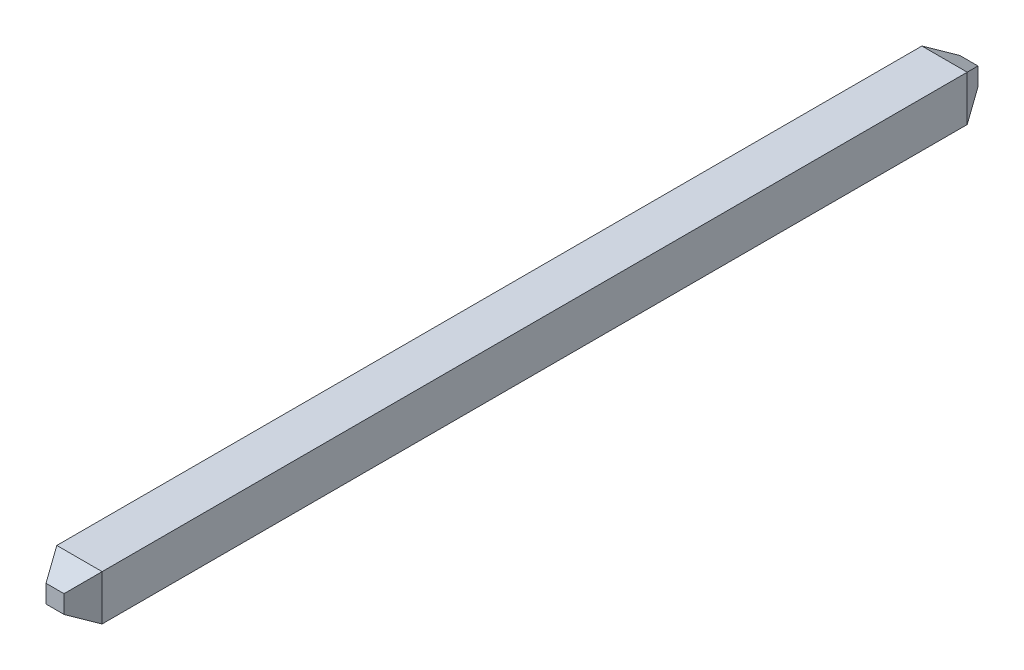
ISO-10303-21;
HEADER;
FILE_DESCRIPTION(('STEP AP214'),'2;1');
FILE_NAME('part.step','',(''),(''),'','','');
FILE_SCHEMA(('AUTOMOTIVE_DESIGN { 1 0 10303 214 1 1 1 1 }'));
ENDSEC;
DATA;
#1=APPLICATION_CONTEXT('core data for automotive mechanical design processes');
#2=APPLICATION_PROTOCOL_DEFINITION('international standard','automotive_design',2000,#1);
#3=PRODUCT_CONTEXT('',#1,'mechanical');
#4=PRODUCT('Part','Part','',(#3));
#5=PRODUCT_RELATED_PRODUCT_CATEGORY('part','',(#4));
#6=PRODUCT_DEFINITION_FORMATION('','',#4);
#7=PRODUCT_DEFINITION_CONTEXT('part definition',#1,'design');
#8=PRODUCT_DEFINITION('design','',#6,#7);
#9=PRODUCT_DEFINITION_SHAPE('','',#8);
#10=(LENGTH_UNIT() NAMED_UNIT(*) SI_UNIT(.MILLI.,.METRE.));
#11=(NAMED_UNIT(*) PLANE_ANGLE_UNIT() SI_UNIT($,.RADIAN.));
#12=(NAMED_UNIT(*) SI_UNIT($,.STERADIAN.) SOLID_ANGLE_UNIT());
#13=UNCERTAINTY_MEASURE_WITH_UNIT(LENGTH_MEASURE(1.E-05),#10,'distance_accuracy_value','');
#14=(GEOMETRIC_REPRESENTATION_CONTEXT(3) GLOBAL_UNCERTAINTY_ASSIGNED_CONTEXT((#13)) GLOBAL_UNIT_ASSIGNED_CONTEXT((#10,
#11,#12)) REPRESENTATION_CONTEXT('',''));
#15=CARTESIAN_POINT('',(0.,0.,0.));
#16=DIRECTION('',(0.,0.,1.));
#17=DIRECTION('',(1.,0.,0.));
#18=AXIS2_PLACEMENT_3D('',#15,#16,#17);
#19=CARTESIAN_POINT('',(0.120115100419239,0.945,-3.20872569516347));
#20=DIRECTION('',(0.872569516347454,0.,-0.488489958076081));
#21=DIRECTION('',(-0.488489958076081,0.,-0.872569516347454));
#22=AXIS2_PLACEMENT_3D('',#19,#20,#21);
#23=PLANE('',#22);
#24=DIRECTION('',(0.,1.,0.));
#25=VECTOR('',#24,1.);
#26=CARTESIAN_POINT('',(0.315341856644683,0.944999999999999,-2.86000017186176));
#27=LINE('',#26,#25);
#28=CARTESIAN_POINT('',(0.315341856632625,0.954999975315067,-2.85999984563027));
#29=VERTEX_POINT('',#28);
#30=CARTESIAN_POINT('',(0.315342017291865,1.58500016035866,-2.8599998849043));
#31=VERTEX_POINT('',#30);
#32=EDGE_CURVE('E146',#29,#31,#27,.T.);
#33=ORIENTED_EDGE('',*,*,#32,.F.);
#34=DIRECTION('',(0.439072617568639,-0.438284036988113,0.784297353956282));
#35=VECTOR('',#34,1.);
#36=CARTESIAN_POINT('',(0.125000000000004,1.145,-3.2));
#37=LINE('',#36,#35);
#38=CARTESIAN_POINT('',(0.125000000000003,1.145,-3.2));
#39=VERTEX_POINT('',#38);
#40=EDGE_CURVE('E143',#39,#29,#37,.T.);
#41=ORIENTED_EDGE('',*,*,#40,.F.);
#42=DIRECTION('',(0.,1.,0.));
#43=VECTOR('',#42,1.);
#44=CARTESIAN_POINT('',(0.125000000000004,1.135,-3.2));
#45=LINE('',#44,#43);
#46=CARTESIAN_POINT('',(0.125000000000003,1.395,-3.2));
#47=VERTEX_POINT('',#46);
#48=EDGE_CURVE('E95',#47,#39,#45,.F.);
#49=ORIENTED_EDGE('',*,*,#48,.F.);
#50=DIRECTION('',(-0.439072617568639,-0.438284036988113,-0.784297353956282));
#51=VECTOR('',#50,1.);
#52=CARTESIAN_POINT('',(0.315341856644679,1.585,-2.86000017186176));
#53=LINE('',#52,#51);
#54=EDGE_CURVE('E135',#31,#47,#53,.T.);
#55=ORIENTED_EDGE('',*,*,#54,.F.);
#56=EDGE_LOOP('',(#33,#41,#49,#55));
#57=FACE_BOUND('',#56,.T.);
#58=ADVANCED_FACE('F16',(#57),#23,.T.);
#59=CARTESIAN_POINT('',(0.12036702814295,0.945,9.50441734607014));
#60=DIRECTION('',(0.873317045523297,0.,0.487152273933377));
#61=DIRECTION('',(0.487152273933377,0.,-0.873317045523297));
#62=AXIS2_PLACEMENT_3D('',#59,#60,#61);
#63=PLANE('',#62);
#64=DIRECTION('',(-0.437799852400895,0.438586917260846,0.784839349959839));
#65=VECTOR('',#64,1.);
#66=CARTESIAN_POINT('',(0.314897899551643,0.954999686828527,9.15568378706484));
#67=LINE('',#66,#65);
#68=CARTESIAN_POINT('',(0.314897654549926,0.954999891076848,9.15568368845102));
#69=VERTEX_POINT('',#68);
#70=CARTESIAN_POINT('',(0.125238550882283,1.145,9.49568417561491));
#71=VERTEX_POINT('',#70);
#72=EDGE_CURVE('E152',#69,#71,#67,.T.);
#73=ORIENTED_EDGE('',*,*,#72,.F.);
#74=DIRECTION('',(0.,1.,0.));
#75=VECTOR('',#74,1.);
#76=CARTESIAN_POINT('',(0.314898539006426,0.944999999999999,9.15568372243698));
#77=LINE('',#76,#75);
#78=CARTESIAN_POINT('',(0.31489765280461,1.5850001770326,9.15568371270385));
#79=VERTEX_POINT('',#78);
#80=EDGE_CURVE('E106',#79,#69,#77,.F.);
#81=ORIENTED_EDGE('',*,*,#80,.F.);
#82=DIRECTION('',(0.437799852400897,0.438586917260845,-0.784839349959839));
#83=VECTOR('',#82,1.);
#84=CARTESIAN_POINT('',(0.125238550882283,1.395,9.49568417561491));
#85=LINE('',#84,#83);
#86=CARTESIAN_POINT('',(0.125238550882283,1.395,9.49568417561491));
#87=VERTEX_POINT('',#86);
#88=EDGE_CURVE('E101',#87,#79,#85,.T.);
#89=ORIENTED_EDGE('',*,*,#88,.F.);
#90=DIRECTION('',(0.,1.,0.));
#91=VECTOR('',#90,1.);
#92=CARTESIAN_POINT('',(0.125238550882283,1.405,9.49568417561491));
#93=LINE('',#92,#91);
#94=EDGE_CURVE('E19',#71,#87,#93,.T.);
#95=ORIENTED_EDGE('',*,*,#94,.F.);
#96=EDGE_LOOP('',(#73,#81,#89,#95));
#97=FACE_BOUND('',#96,.T.);
#98=ADVANCED_FACE('F103',(#97),#63,.T.);
#99=CARTESIAN_POINT('',(-0.134761449117717,1.405,9.49568417561491));
#100=DIRECTION('',(0.,0.,1.));
#101=DIRECTION('',(1.,0.,0.));
#102=AXIS2_PLACEMENT_3D('',#99,#100,#101);
#103=PLANE('',#102);
#104=DIRECTION('',(1.,0.,0.));
#105=VECTOR('',#104,1.);
#106=CARTESIAN_POINT('',(-0.325103305762397,1.395,9.49568417561491));
#107=LINE('',#106,#105);
#108=CARTESIAN_POINT('',(-0.124761449117717,1.395,9.49568417561491));
#109=VERTEX_POINT('',#108);
#110=EDGE_CURVE('E111',#109,#87,#107,.T.);
#111=ORIENTED_EDGE('',*,*,#110,.F.);
#112=DIRECTION('',(0.,1.,0.));
#113=VECTOR('',#112,1.);
#114=CARTESIAN_POINT('',(-0.124761449117719,0.945,9.49568417561491));
#115=LINE('',#114,#113);
#116=CARTESIAN_POINT('',(-0.124761449117718,1.145,9.49568417561491));
#117=VERTEX_POINT('',#116);
#118=EDGE_CURVE('E162',#117,#109,#115,.T.);
#119=ORIENTED_EDGE('',*,*,#118,.F.);
#120=DIRECTION('',(1.,0.,0.));
#121=VECTOR('',#120,1.);
#122=CARTESIAN_POINT('',(-0.325103305762399,1.145,9.49568417561491));
#123=LINE('',#122,#121);
#124=EDGE_CURVE('E116',#71,#117,#123,.F.);
#125=ORIENTED_EDGE('',*,*,#124,.F.);
#126=ORIENTED_EDGE('',*,*,#94,.T.);
#127=EDGE_LOOP('',(#111,#119,#125,#126));
#128=FACE_BOUND('',#127,.T.);
#129=ADVANCED_FACE('F113',(#128),#103,.T.);
#130=CARTESIAN_POINT('',(-0.325103305762397,1.39012178454432,9.50441360938624));
#131=DIRECTION('',(0.,0.872943377132664,0.487821545567864));
#132=DIRECTION('',(0.,-0.487821545567864,0.872943377132664));
#133=AXIS2_PLACEMENT_3D('',#130,#131,#132);
#134=PLANE('',#133);
#135=DIRECTION('',(-0.439072459537935,0.438284700441641,-0.78429707167252));
#136=VECTOR('',#135,1.);
#137=CARTESIAN_POINT('',(-0.124761449117719,1.395,9.49568417561491));
#138=LINE('',#137,#136);
#139=CARTESIAN_POINT('',(-0.315102496297201,1.58500008247257,9.15568447138296));
#140=VERTEX_POINT('',#139);
#141=EDGE_CURVE('E121',#109,#140,#138,.T.);
#142=ORIENTED_EDGE('',*,*,#141,.F.);
#143=ORIENTED_EDGE('',*,*,#110,.T.);
#144=ORIENTED_EDGE('',*,*,#88,.T.);
#145=DIRECTION('',(1.,0.,0.));
#146=VECTOR('',#145,1.);
#147=CARTESIAN_POINT('',(6.65893728155065E-05,1.585,9.15568497320463));
#148=LINE('',#147,#146);
#149=EDGE_CURVE('E164',#140,#79,#148,.T.);
#150=ORIENTED_EDGE('',*,*,#149,.F.);
#151=EDGE_LOOP('',(#142,#143,#144,#150));
#152=FACE_BOUND('',#151,.T.);
#153=ADVANCED_FACE('F119',(#152),#134,.T.);
#154=CARTESIAN_POINT('',(-0.135,1.135,-3.2));
#155=DIRECTION('',(0.,0.,-1.));
#156=DIRECTION('',(-1.,0.,0.));
#157=AXIS2_PLACEMENT_3D('',#154,#155,#156);
#158=PLANE('',#157);
#159=ORIENTED_EDGE('',*,*,#48,.T.);
#160=DIRECTION('',(1.,0.,0.));
#161=VECTOR('',#160,1.);
#162=CARTESIAN_POINT('',(-0.324658143355321,1.145,-3.2));
#163=LINE('',#162,#161);
#164=CARTESIAN_POINT('',(-0.124999999999996,1.145,-3.2));
#165=VERTEX_POINT('',#164);
#166=EDGE_CURVE('E139',#165,#39,#163,.T.);
#167=ORIENTED_EDGE('',*,*,#166,.F.);
#168=DIRECTION('',(0.,1.,0.));
#169=VECTOR('',#168,1.);
#170=CARTESIAN_POINT('',(-0.124999999999998,0.945,-3.2));
#171=LINE('',#170,#169);
#172=CARTESIAN_POINT('',(-0.124999999999996,1.395,-3.2));
#173=VERTEX_POINT('',#172);
#174=EDGE_CURVE('E176',#173,#165,#171,.F.);
#175=ORIENTED_EDGE('',*,*,#174,.F.);
#176=DIRECTION('',(1.,0.,0.));
#177=VECTOR('',#176,1.);
#178=CARTESIAN_POINT('',(-0.32465814335532,1.395,-3.2));
#179=LINE('',#178,#177);
#180=EDGE_CURVE('E129',#47,#173,#179,.F.);
#181=ORIENTED_EDGE('',*,*,#180,.F.);
#182=EDGE_LOOP('',(#159,#167,#175,#181));
#183=FACE_BOUND('',#182,.T.);
#184=ADVANCED_FACE('F229',(#183),#158,.T.);
#185=CARTESIAN_POINT('',(-0.32465814335532,1.58987821545568,-2.85127073809043));
#186=DIRECTION('',(0.,0.872943377132663,-0.487821545567865));
#187=DIRECTION('',(0.,0.487821545567865,0.872943377132663));
#188=AXIS2_PLACEMENT_3D('',#185,#186,#187);
#189=PLANE('',#188);
#190=DIRECTION('',(1.,0.,0.));
#191=VECTOR('',#190,1.);
#192=CARTESIAN_POINT('',(6.65893728155065E-05,1.585,-2.86000017186176));
#193=LINE('',#192,#191);
#194=CARTESIAN_POINT('',(-0.314658552313813,1.5850007068091,-2.8599984305592));
#195=VERTEX_POINT('',#194);
#196=EDGE_CURVE('E172',#31,#195,#193,.F.);
#197=ORIENTED_EDGE('',*,*,#196,.F.);
#198=ORIENTED_EDGE('',*,*,#54,.T.);
#199=ORIENTED_EDGE('',*,*,#180,.T.);
#200=DIRECTION('',(0.437798396819594,-0.438586429089658,-0.784840434713054));
#201=VECTOR('',#200,1.);
#202=CARTESIAN_POINT('',(-0.314659335924682,1.58500072063078,-2.85999803394471));
#203=LINE('',#202,#201);
#204=EDGE_CURVE('E183',#195,#173,#203,.T.);
#205=ORIENTED_EDGE('',*,*,#204,.F.);
#206=EDGE_LOOP('',(#197,#198,#199,#205));
#207=FACE_BOUND('',#206,.T.);
#208=ADVANCED_FACE('F227',(#207),#189,.T.);
#209=CARTESIAN_POINT('',(-0.324658143355321,1.14987821545568,-3.20872943377133));
#210=DIRECTION('',(0.,-0.872943377132663,-0.487821545567865));
#211=DIRECTION('',(0.,0.487821545567865,-0.872943377132663));
#212=AXIS2_PLACEMENT_3D('',#209,#210,#211);
#213=PLANE('',#212);
#214=ORIENTED_EDGE('',*,*,#166,.T.);
#215=ORIENTED_EDGE('',*,*,#40,.T.);
#216=DIRECTION('',(1.,0.,0.));
#217=VECTOR('',#216,1.);
#218=CARTESIAN_POINT('',(-0.325051653144535,0.955,-2.85999756200982));
#219=LINE('',#218,#217);
#220=CARTESIAN_POINT('',(-0.314658017815116,0.954999729763457,-2.85999898491791));
#221=VERTEX_POINT('',#220);
#222=EDGE_CURVE('E39',#221,#29,#219,.T.);
#223=ORIENTED_EDGE('',*,*,#222,.F.);
#224=DIRECTION('',(-0.437798396819593,-0.438586429089662,0.784840434713052));
#225=VECTOR('',#224,1.);
#226=CARTESIAN_POINT('',(-0.124999999999998,1.145,-3.2));
#227=LINE('',#226,#225);
#228=EDGE_CURVE('E180',#165,#221,#227,.T.);
#229=ORIENTED_EDGE('',*,*,#228,.F.);
#230=EDGE_LOOP('',(#214,#215,#223,#229));
#231=FACE_BOUND('',#230,.T.);
#232=ADVANCED_FACE('F230',(#231),#213,.T.);
#233=CARTESIAN_POINT('',(0.315346308268754,0.944999999999999,-2.98065701705514));
#234=DIRECTION('',(0.999999999319383,0.,3.68949151671738E-05));
#235=DIRECTION('',(3.68949151671738E-05,0.,-0.999999999319383));
#236=AXIS2_PLACEMENT_3D('',#233,#234,#235);
#237=PLANE('',#236);
#238=DIRECTION('',(3.69481335093583E-05,0.,-0.999999999317418));
#239=VECTOR('',#238,1.);
#240=CARTESIAN_POINT('',(0.314897899551644,1.585,9.15568372241339));
#241=LINE('',#240,#239);
#242=EDGE_CURVE('E168',#79,#31,#241,.T.);
#243=ORIENTED_EDGE('',*,*,#242,.F.);
#244=ORIENTED_EDGE('',*,*,#80,.T.);
#245=DIRECTION('',(-3.69481335094485E-05,0.,0.999999999317418));
#246=VECTOR('',#245,1.);
#247=CARTESIAN_POINT('',(0.315341856644679,0.955,-2.86000017186176));
#248=LINE('',#247,#246);
#249=EDGE_CURVE('E189',#29,#69,#248,.T.);
#250=ORIENTED_EDGE('',*,*,#249,.F.);
#251=ORIENTED_EDGE('',*,*,#32,.T.);
#252=EDGE_LOOP('',(#243,#244,#250,#251));
#253=FACE_BOUND('',#252,.T.);
#254=ADVANCED_FACE('F232',(#253),#237,.T.);
#255=CARTESIAN_POINT('',(-0.325103305762399,0.950121784544321,9.14695491370534));
#256=DIRECTION('',(0.,-0.872943377132664,0.487821545567865));
#257=DIRECTION('',(0.,-0.487821545567865,-0.872943377132664));
#258=AXIS2_PLACEMENT_3D('',#255,#256,#257);
#259=PLANE('',#258);
#260=ORIENTED_EDGE('',*,*,#124,.T.);
#261=DIRECTION('',(0.439072459537931,0.438284700441657,0.784297071672513));
#262=VECTOR('',#261,1.);
#263=CARTESIAN_POINT('',(-0.315102751134454,0.955000197635095,9.15568533818575));
#264=LINE('',#263,#262);
#265=CARTESIAN_POINT('',(-0.315102182397624,0.955000116075707,9.15568487573228));
#266=VERTEX_POINT('',#265);
#267=EDGE_CURVE('E158',#266,#117,#264,.T.);
#268=ORIENTED_EDGE('',*,*,#267,.F.);
#269=DIRECTION('',(1.,0.,0.));
#270=VECTOR('',#269,1.);
#271=CARTESIAN_POINT('',(-0.325051653144535,0.955,9.15568372241339));
#272=LINE('',#271,#270);
#273=EDGE_CURVE('E193',#69,#266,#272,.F.);
#274=ORIENTED_EDGE('',*,*,#273,.F.);
#275=ORIENTED_EDGE('',*,*,#72,.T.);
#276=EDGE_LOOP('',(#260,#268,#274,#275));
#277=FACE_BOUND('',#276,.T.);
#278=ADVANCED_FACE('F219',(#277),#259,.T.);
#279=CARTESIAN_POINT('',(-0.119876549536956,0.945,9.50440987077839));
#280=DIRECTION('',(-0.872569516347453,0.,0.488489958076082));
#281=DIRECTION('',(0.488489958076082,0.,0.872569516347453));
#282=AXIS2_PLACEMENT_3D('',#279,#280,#281);
#283=PLANE('',#282);
#284=ORIENTED_EDGE('',*,*,#267,.T.);
#285=ORIENTED_EDGE('',*,*,#118,.T.);
#286=ORIENTED_EDGE('',*,*,#141,.T.);
#287=DIRECTION('',(0.,1.,0.));
#288=VECTOR('',#287,1.);
#289=CARTESIAN_POINT('',(-0.315101461039725,0.945,9.15568497322818));
#290=LINE('',#289,#288);
#291=EDGE_CURVE('E197',#266,#140,#290,.T.);
#292=ORIENTED_EDGE('',*,*,#291,.F.);
#293=EDGE_LOOP('',(#284,#285,#286,#292));
#294=FACE_BOUND('',#293,.T.);
#295=ADVANCED_FACE('F222',(#294),#283,.T.);
#296=CARTESIAN_POINT('',(6.65893728155065E-05,1.585,9.32634470275115));
#297=DIRECTION('',(0.,1.,0.));
#298=DIRECTION('',(0.,0.,1.));
#299=AXIS2_PLACEMENT_3D('',#296,#297,#298);
#300=PLANE('',#299);
#301=ORIENTED_EDGE('',*,*,#196,.T.);
#302=DIRECTION('',(-3.68949151674615E-05,0.,0.999999999319383));
#303=VECTOR('',#302,1.);
#304=CARTESIAN_POINT('',(-0.31510775764562,1.5849998023649,9.32634821671993));
#305=LINE('',#304,#303);
#306=EDGE_CURVE('E201',#140,#195,#305,.F.);
#307=ORIENTED_EDGE('',*,*,#306,.F.);
#308=ORIENTED_EDGE('',*,*,#149,.T.);
#309=ORIENTED_EDGE('',*,*,#242,.T.);
#310=EDGE_LOOP('',(#301,#307,#308,#309));
#311=FACE_BOUND('',#310,.T.);
#312=ADVANCED_FACE('F224',(#311),#300,.T.);
#313=CARTESIAN_POINT('',(-0.120128477260666,0.945,-3.20873317045523));
#314=DIRECTION('',(-0.873317045523297,0.,-0.487152273933376));
#315=DIRECTION('',(-0.487152273933376,0.,0.873317045523297));
#316=AXIS2_PLACEMENT_3D('',#313,#314,#315);
#317=PLANE('',#316);
#318=DIRECTION('',(0.,1.,0.));
#319=VECTOR('',#318,1.);
#320=CARTESIAN_POINT('',(-0.314658143451607,0.945,-2.85999756199704));
#321=LINE('',#320,#319);
#322=EDGE_CURVE('E26',#195,#221,#321,.F.);
#323=ORIENTED_EDGE('',*,*,#322,.F.);
#324=ORIENTED_EDGE('',*,*,#204,.T.);
#325=ORIENTED_EDGE('',*,*,#174,.T.);
#326=ORIENTED_EDGE('',*,*,#228,.T.);
#327=EDGE_LOOP('',(#323,#324,#325,#326));
#328=FACE_BOUND('',#327,.T.);
#329=ADVANCED_FACE('F213',(#328),#317,.T.);
#330=CARTESIAN_POINT('',(-0.325051653144535,0.955,3.17284922525592));
#331=DIRECTION('',(0.,-1.,0.));
#332=DIRECTION('',(0.,0.,-1.));
#333=AXIS2_PLACEMENT_3D('',#330,#331,#332);
#334=PLANE('',#333);
#335=ORIENTED_EDGE('',*,*,#249,.T.);
#336=ORIENTED_EDGE('',*,*,#273,.T.);
#337=DIRECTION('',(-3.68949151674615E-05,0.,0.999999999319383));
#338=VECTOR('',#337,1.);
#339=CARTESIAN_POINT('',(-0.31510775764562,0.954999279369218,9.32634821671993));
#340=LINE('',#339,#338);
#341=EDGE_CURVE('E11',#221,#266,#340,.T.);
#342=ORIENTED_EDGE('',*,*,#341,.F.);
#343=ORIENTED_EDGE('',*,*,#222,.T.);
#344=EDGE_LOOP('',(#335,#336,#342,#343));
#345=FACE_BOUND('',#344,.T.);
#346=ADVANCED_FACE('F215',(#345),#334,.T.);
#347=CARTESIAN_POINT('',(-0.31510775764562,0.945,9.32634821671993));
#348=DIRECTION('',(-0.999999999319383,0.,-3.68949151674615E-05));
#349=DIRECTION('',(-3.68949151674615E-05,0.,0.999999999319383));
#350=AXIS2_PLACEMENT_3D('',#347,#348,#349);
#351=PLANE('',#350);
#352=ORIENTED_EDGE('',*,*,#322,.T.);
#353=ORIENTED_EDGE('',*,*,#341,.T.);
#354=ORIENTED_EDGE('',*,*,#291,.T.);
#355=ORIENTED_EDGE('',*,*,#306,.T.);
#356=EDGE_LOOP('',(#352,#353,#354,#355));
#357=FACE_BOUND('',#356,.T.);
#358=ADVANCED_FACE('F209',(#357),#351,.T.);
#359=CLOSED_SHELL('',(#58,#98,#129,#153,#184,#208,#232,#254,#278,#295,#312,#329,#346,#358));
#360=MANIFOLD_SOLID_BREP('B1',#359);
#361=ADVANCED_BREP_SHAPE_REPRESENTATION('',(#18,#360),#14);
#362=SHAPE_DEFINITION_REPRESENTATION(#9,#361);
ENDSEC;
END-ISO-10303-21;
